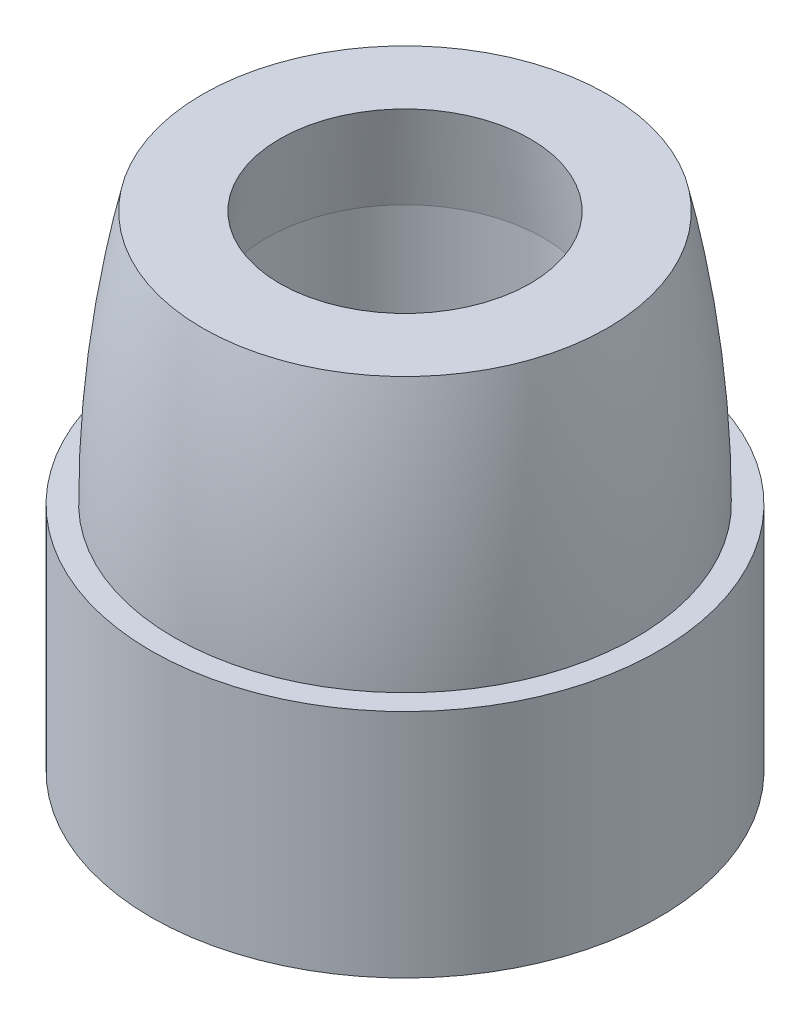
ISO-10303-21;
HEADER;
FILE_DESCRIPTION(('STEP AP214'),'2;1');
FILE_NAME('part.step','',(''),(''),'','','');
FILE_SCHEMA(('AUTOMOTIVE_DESIGN { 1 0 10303 214 1 1 1 1 }'));
ENDSEC;
DATA;
#1=APPLICATION_CONTEXT('core data for automotive mechanical design processes');
#2=APPLICATION_PROTOCOL_DEFINITION('international standard','automotive_design',2000,#1);
#3=PRODUCT_CONTEXT('',#1,'mechanical');
#4=PRODUCT('Part','Part','',(#3));
#5=PRODUCT_RELATED_PRODUCT_CATEGORY('part','',(#4));
#6=PRODUCT_DEFINITION_FORMATION('','',#4);
#7=PRODUCT_DEFINITION_CONTEXT('part definition',#1,'design');
#8=PRODUCT_DEFINITION('design','',#6,#7);
#9=PRODUCT_DEFINITION_SHAPE('','',#8);
#10=(LENGTH_UNIT() NAMED_UNIT(*) SI_UNIT(.MILLI.,.METRE.));
#11=(NAMED_UNIT(*) PLANE_ANGLE_UNIT() SI_UNIT($,.RADIAN.));
#12=(NAMED_UNIT(*) SI_UNIT($,.STERADIAN.) SOLID_ANGLE_UNIT());
#13=UNCERTAINTY_MEASURE_WITH_UNIT(LENGTH_MEASURE(1.E-05),#10,'distance_accuracy_value','');
#14=(GEOMETRIC_REPRESENTATION_CONTEXT(3) GLOBAL_UNCERTAINTY_ASSIGNED_CONTEXT((#13)) GLOBAL_UNIT_ASSIGNED_CONTEXT((#10,
#11,#12)) REPRESENTATION_CONTEXT('',''));
#15=CARTESIAN_POINT('',(0.,0.,0.));
#16=DIRECTION('',(0.,0.,1.));
#17=DIRECTION('',(1.,0.,0.));
#18=AXIS2_PLACEMENT_3D('',#15,#16,#17);
#19=CARTESIAN_POINT('',(0.,5.,0.));
#20=DIRECTION('',(0.,-1.,0.));
#21=DIRECTION('',(0.,0.,-1.));
#22=AXIS2_PLACEMENT_3D('',#19,#20,#21);
#23=DEGENERATE_TOROIDAL_SURFACE('',#22,20.,25.,.F.);
#24=CARTESIAN_POINT('',(0.,5.,0.));
#25=DIRECTION('',(0.,-1.,0.));
#26=DIRECTION('',(0.,0.,-1.));
#27=AXIS2_PLACEMENT_3D('',#24,#25,#26);
#28=CIRCLE('',#27,5.);
#29=CARTESIAN_POINT('',(0.,5.,-5.));
#30=VERTEX_POINT('',#29);
#31=EDGE_CURVE('E43',#30,#30,#28,.T.);
#32=ORIENTED_EDGE('',*,*,#31,.F.);
#33=EDGE_LOOP('',(#32));
#34=FACE_BOUND('',#33,.T.);
#35=CARTESIAN_POINT('',(0.,10.5,0.));
#36=DIRECTION('',(0.,1.,0.));
#37=DIRECTION('',(0.,0.,1.));
#38=AXIS2_PLACEMENT_3D('',#35,#36,#37);
#39=CIRCLE('',#38,4.3874967965144);
#40=CARTESIAN_POINT('',(0.,10.5,4.3874967965144));
#41=VERTEX_POINT('',#40);
#42=EDGE_CURVE('E65',#41,#41,#39,.F.);
#43=ORIENTED_EDGE('',*,*,#42,.T.);
#44=EDGE_LOOP('',(#43));
#45=FACE_BOUND('',#44,.T.);
#46=ADVANCED_FACE('F35',(#34,#45),#23,.F.);
#47=CARTESIAN_POINT('',(0.,12.,0.));
#48=DIRECTION('',(0.,-1.,0.));
#49=DIRECTION('',(0.,0.,-1.));
#50=AXIS2_PLACEMENT_3D('',#47,#48,#49);
#51=CONICAL_SURFACE('',#50,2.5,0.141897054604164);
#52=CARTESIAN_POINT('',(0.,8.5,0.));
#53=DIRECTION('',(0.,-1.,0.));
#54=DIRECTION('',(0.,0.,-1.));
#55=AXIS2_PLACEMENT_3D('',#52,#53,#54);
#56=CIRCLE('',#55,3.);
#57=CARTESIAN_POINT('',(0.,8.5,-3.));
#58=VERTEX_POINT('',#57);
#59=EDGE_CURVE('E48',#58,#58,#56,.T.);
#60=ORIENTED_EDGE('',*,*,#59,.T.);
#61=EDGE_LOOP('',(#60));
#62=FACE_BOUND('',#61,.T.);
#63=CARTESIAN_POINT('',(0.,10.5,0.));
#64=DIRECTION('',(0.,1.,0.));
#65=DIRECTION('',(0.,0.,1.));
#66=AXIS2_PLACEMENT_3D('',#63,#64,#65);
#67=CIRCLE('',#66,2.71428571428571);
#68=CARTESIAN_POINT('',(0.,10.5,2.71428571428571));
#69=VERTEX_POINT('',#68);
#70=EDGE_CURVE('E39',#69,#69,#67,.T.);
#71=ORIENTED_EDGE('',*,*,#70,.T.);
#72=EDGE_LOOP('',(#71));
#73=FACE_BOUND('',#72,.T.);
#74=ADVANCED_FACE('F71',(#62,#73),#51,.F.);
#75=CARTESIAN_POINT('',(0.,0.,0.));
#76=DIRECTION('',(0.,-1.,0.));
#77=DIRECTION('',(0.,0.,-1.));
#78=AXIS2_PLACEMENT_3D('',#75,#76,#77);
#79=CYLINDRICAL_SURFACE('',#78,3.);
#80=ORIENTED_EDGE('',*,*,#59,.F.);
#81=EDGE_LOOP('',(#80));
#82=FACE_BOUND('',#81,.T.);
#83=CARTESIAN_POINT('',(0.,4.,0.));
#84=DIRECTION('',(0.,-1.,0.));
#85=DIRECTION('',(0.,0.,-1.));
#86=AXIS2_PLACEMENT_3D('',#83,#84,#85);
#87=CIRCLE('',#86,3.);
#88=CARTESIAN_POINT('',(0.,4.,-3.));
#89=VERTEX_POINT('',#88);
#90=EDGE_CURVE('E51',#89,#89,#87,.T.);
#91=ORIENTED_EDGE('',*,*,#90,.T.);
#92=EDGE_LOOP('',(#91));
#93=FACE_BOUND('',#92,.T.);
#94=ADVANCED_FACE('F74',(#82,#93),#79,.F.);
#95=CARTESIAN_POINT('',(0.,0.,0.));
#96=DIRECTION('',(0.,-1.,0.));
#97=DIRECTION('',(0.,0.,-1.));
#98=AXIS2_PLACEMENT_3D('',#95,#96,#97);
#99=CYLINDRICAL_SURFACE('',#98,5.5);
#100=CARTESIAN_POINT('',(0.,5.,0.));
#101=DIRECTION('',(0.,-1.,0.));
#102=DIRECTION('',(0.,0.,-1.));
#103=AXIS2_PLACEMENT_3D('',#100,#101,#102);
#104=CIRCLE('',#103,5.5);
#105=CARTESIAN_POINT('',(0.,5.,-5.5));
#106=VERTEX_POINT('',#105);
#107=EDGE_CURVE('E10',#106,#106,#104,.T.);
#108=ORIENTED_EDGE('',*,*,#107,.T.);
#109=EDGE_LOOP('',(#108));
#110=FACE_BOUND('',#109,.T.);
#111=CARTESIAN_POINT('',(0.,0.,0.));
#112=DIRECTION('',(0.,-1.,0.));
#113=DIRECTION('',(0.,0.,-1.));
#114=AXIS2_PLACEMENT_3D('',#111,#112,#113);
#115=CIRCLE('',#114,5.5);
#116=CARTESIAN_POINT('',(0.,0.,-5.5));
#117=VERTEX_POINT('',#116);
#118=EDGE_CURVE('E53',#117,#117,#115,.T.);
#119=ORIENTED_EDGE('',*,*,#118,.F.);
#120=EDGE_LOOP('',(#119));
#121=FACE_BOUND('',#120,.T.);
#122=ADVANCED_FACE('F37',(#110,#121),#99,.T.);
#123=CARTESIAN_POINT('',(5.5,5.,0.));
#124=DIRECTION('',(0.,1.,0.));
#125=DIRECTION('',(0.,0.,1.));
#126=AXIS2_PLACEMENT_3D('',#123,#124,#125);
#127=PLANE('',#126);
#128=ORIENTED_EDGE('',*,*,#31,.T.);
#129=EDGE_LOOP('',(#128));
#130=FACE_BOUND('',#129,.T.);
#131=ORIENTED_EDGE('',*,*,#107,.F.);
#132=EDGE_LOOP('',(#131));
#133=FACE_BOUND('',#132,.T.);
#134=ADVANCED_FACE('F81',(#130,#133),#127,.T.);
#135=CARTESIAN_POINT('',(3.,0.,0.));
#136=DIRECTION('',(0.,-1.,0.));
#137=DIRECTION('',(0.,0.,-1.));
#138=AXIS2_PLACEMENT_3D('',#135,#136,#137);
#139=PLANE('',#138);
#140=CARTESIAN_POINT('',(0.,0.,0.));
#141=DIRECTION('',(0.,-1.,0.));
#142=DIRECTION('',(0.,0.,-1.));
#143=AXIS2_PLACEMENT_3D('',#140,#141,#142);
#144=CIRCLE('',#143,4.);
#145=CARTESIAN_POINT('',(0.,0.,-4.));
#146=VERTEX_POINT('',#145);
#147=EDGE_CURVE('E60',#146,#146,#144,.T.);
#148=ORIENTED_EDGE('',*,*,#147,.F.);
#149=EDGE_LOOP('',(#148));
#150=FACE_BOUND('',#149,.T.);
#151=ORIENTED_EDGE('',*,*,#118,.T.);
#152=EDGE_LOOP('',(#151));
#153=FACE_BOUND('',#152,.T.);
#154=ADVANCED_FACE('F92',(#150,#153),#139,.T.);
#155=CARTESIAN_POINT('',(0.,4.,0.));
#156=DIRECTION('',(0.,-1.,0.));
#157=DIRECTION('',(0.,0.,-1.));
#158=AXIS2_PLACEMENT_3D('',#155,#156,#157);
#159=CYLINDRICAL_SURFACE('',#158,4.);
#160=CARTESIAN_POINT('',(0.,4.,0.));
#161=DIRECTION('',(0.,-1.,0.));
#162=DIRECTION('',(0.,0.,-1.));
#163=AXIS2_PLACEMENT_3D('',#160,#161,#162);
#164=CIRCLE('',#163,4.);
#165=CARTESIAN_POINT('',(0.,4.,-4.));
#166=VERTEX_POINT('',#165);
#167=EDGE_CURVE('E54',#166,#166,#164,.T.);
#168=ORIENTED_EDGE('',*,*,#167,.F.);
#169=EDGE_LOOP('',(#168));
#170=FACE_BOUND('',#169,.T.);
#171=ORIENTED_EDGE('',*,*,#147,.T.);
#172=EDGE_LOOP('',(#171));
#173=FACE_BOUND('',#172,.T.);
#174=ADVANCED_FACE('F97',(#170,#173),#159,.F.);
#175=CARTESIAN_POINT('',(0.,4.,0.));
#176=DIRECTION('',(0.,-1.,0.));
#177=DIRECTION('',(0.,0.,-1.));
#178=AXIS2_PLACEMENT_3D('',#175,#176,#177);
#179=PLANE('',#178);
#180=ORIENTED_EDGE('',*,*,#90,.F.);
#181=EDGE_LOOP('',(#180));
#182=FACE_BOUND('',#181,.T.);
#183=ORIENTED_EDGE('',*,*,#167,.T.);
#184=EDGE_LOOP('',(#183));
#185=FACE_BOUND('',#184,.T.);
#186=ADVANCED_FACE('F103',(#182,#185),#179,.T.);
#187=CARTESIAN_POINT('',(0.,10.5,0.));
#188=DIRECTION('',(0.,1.,0.));
#189=DIRECTION('',(0.,0.,1.));
#190=AXIS2_PLACEMENT_3D('',#187,#188,#189);
#191=PLANE('',#190);
#192=ORIENTED_EDGE('',*,*,#42,.F.);
#193=EDGE_LOOP('',(#192));
#194=FACE_BOUND('',#193,.T.);
#195=ORIENTED_EDGE('',*,*,#70,.F.);
#196=EDGE_LOOP('',(#195));
#197=FACE_BOUND('',#196,.T.);
#198=ADVANCED_FACE('F111',(#194,#197),#191,.T.);
#199=CLOSED_SHELL('',(#46,#74,#94,#122,#134,#154,#174,#186,#198));
#200=MANIFOLD_SOLID_BREP('B2',#199);
#201=ADVANCED_BREP_SHAPE_REPRESENTATION('',(#18,#200),#14);
#202=SHAPE_DEFINITION_REPRESENTATION(#9,#201);
ENDSEC;
END-ISO-10303-21;
